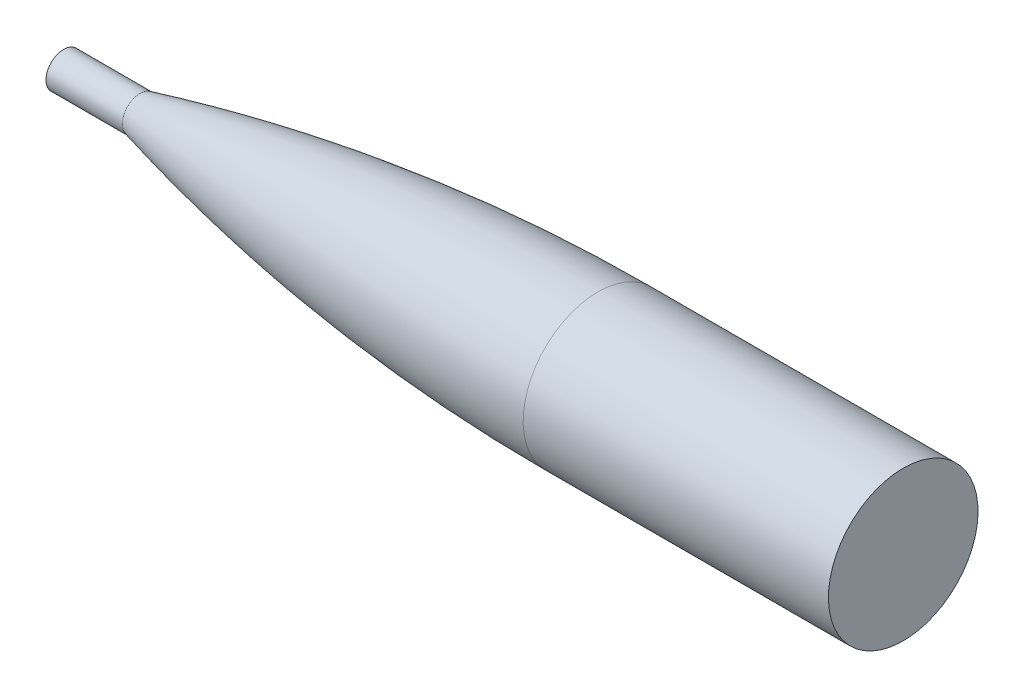
ISO-10303-21;
HEADER;
FILE_DESCRIPTION(('STEP AP214'),'2;1');
FILE_NAME('part.step','',(''),(''),'','','');
FILE_SCHEMA(('AUTOMOTIVE_DESIGN { 1 0 10303 214 1 1 1 1 }'));
ENDSEC;
DATA;
#1=APPLICATION_CONTEXT('core data for automotive mechanical design processes');
#2=APPLICATION_PROTOCOL_DEFINITION('international standard','automotive_design',2000,#1);
#3=PRODUCT_CONTEXT('',#1,'mechanical');
#4=PRODUCT('Part','Part','',(#3));
#5=PRODUCT_RELATED_PRODUCT_CATEGORY('part','',(#4));
#6=PRODUCT_DEFINITION_FORMATION('','',#4);
#7=PRODUCT_DEFINITION_CONTEXT('part definition',#1,'design');
#8=PRODUCT_DEFINITION('design','',#6,#7);
#9=PRODUCT_DEFINITION_SHAPE('','',#8);
#10=(LENGTH_UNIT() NAMED_UNIT(*) SI_UNIT(.MILLI.,.METRE.));
#11=(NAMED_UNIT(*) PLANE_ANGLE_UNIT() SI_UNIT($,.RADIAN.));
#12=(NAMED_UNIT(*) SI_UNIT($,.STERADIAN.) SOLID_ANGLE_UNIT());
#13=UNCERTAINTY_MEASURE_WITH_UNIT(LENGTH_MEASURE(1.E-05),#10,'distance_accuracy_value','');
#14=(GEOMETRIC_REPRESENTATION_CONTEXT(3) GLOBAL_UNCERTAINTY_ASSIGNED_CONTEXT((#13)) GLOBAL_UNIT_ASSIGNED_CONTEXT((#10,
#11,#12)) REPRESENTATION_CONTEXT('',''));
#15=CARTESIAN_POINT('',(0.,0.,0.));
#16=DIRECTION('',(0.,0.,1.));
#17=DIRECTION('',(1.,0.,0.));
#18=AXIS2_PLACEMENT_3D('',#15,#16,#17);
#19=CARTESIAN_POINT('',(304.799999990287,49.7839999999356,0.));
#20=CARTESIAN_POINT('',(304.362420109321,49.7839999999268,0.));
#21=CARTESIAN_POINT('',(303.482211221152,49.7834088052548,0.));
#22=CARTESIAN_POINT('',(301.617177870666,49.7807484292649,0.));
#23=CARTESIAN_POINT('',(299.535126271052,49.7736541034944,0.));
#24=CARTESIAN_POINT('',(297.470177020612,49.7630126402219,0.));
#25=CARTESIAN_POINT('',(295.35918685804,49.7488240698795,0.));
#26=CARTESIAN_POINT('',(293.263778354198,49.7310884330478,0.));
#27=CARTESIAN_POINT('',(291.166731436806,49.7098057804495,0.));
#28=CARTESIAN_POINT('',(288.521672795546,49.6784952503172,0.));
#29=CARTESIAN_POINT('',(285.329649652529,49.6334265452577,0.));
#30=CARTESIAN_POINT('',(281.590188304048,49.5699030834589,0.));
#31=CARTESIAN_POINT('',(277.303691578309,49.48226239004,0.));
#32=CARTESIAN_POINT('',(273.017475856952,49.3798045532393,0.));
#33=CARTESIAN_POINT('',(268.731666264679,49.262530797284,0.));
#34=CARTESIAN_POINT('',(264.446272338637,49.1304425234462,0.));
#35=CARTESIAN_POINT('',(260.161369668181,48.9835413100188,0.));
#36=CARTESIAN_POINT('',(253.734807706703,48.7409727135402,0.));
#37=CARTESIAN_POINT('',(245.168015053762,48.3681837485972,0.));
#38=CARTESIAN_POINT('',(207.702302927604,46.4349626079382,0.));
#39=CARTESIAN_POINT('',(160.707329089507,42.1599209125125,0.));
#40=CARTESIAN_POINT('',(110.770450736802,35.2251211949369,0.));
#41=CARTESIAN_POINT('',(62.3339038753587,25.9763701994142,0.));
#42=CARTESIAN_POINT('',(42.4128979252964,21.742539101878,0.));
#43=CARTESIAN_POINT('',(31.9521680351812,19.4056754890413,0.));
#44=CARTESIAN_POINT('',(26.7272384393463,18.2131472626268,0.));
#45=CARTESIAN_POINT('',(22.5506525227574,17.2446900479098,0.));
#46=CARTESIAN_POINT('',(18.9102609099226,16.3872914736853,0.));
#47=CARTESIAN_POINT('',(15.8050492233456,15.6465359898865,0.));
#48=CARTESIAN_POINT('',(13.2334128844101,15.0268619640981,0.));
#49=CARTESIAN_POINT('',(11.1954442275076,14.5321411193525,0.));
#50=CARTESIAN_POINT('',(9.15994822447513,14.0343879217128,0.));
#51=CARTESIAN_POINT('',(7.11012855188908,13.5293440242189,0.));
#52=CARTESIAN_POINT('',(5.10622259628834,13.032281092588,0.));
#53=CARTESIAN_POINT('',(3.08541050477275,12.5272726670259,0.));
#54=CARTESIAN_POINT('',(1.27776800563499,12.0717339202754,0.));
#55=CARTESIAN_POINT('',(0.424160674864923,11.8559326777936,0.));
#56=CARTESIAN_POINT('',(-8.94262127456441E-09,11.7483971703143,0.));
#57=B_SPLINE_CURVE_WITH_KNOTS('',4,(#19,#20,#21,#22,#23,#24,#25,#26,#27,#28,#29,#30,#31,#32,#33,
#34,#35,#36,#37,#38,#39,#40,#41,#42,#43,#44,#45,#46,#47,#48,#49,#50,#51,#52,#53,#54,#55,#56),
.UNSPECIFIED.,.F.,.F.,(5,1,1,1,1,1,1,1,1,1,1,1,1,1,1,1,1,1,1,1,1,1,1,1,1,1,1,1,1,1,1,1,1,1,5),
(0.0829178151015879,0.0886015106363571,0.0942852061412064,0.0999689016460558,0.105652597150905,
0.111336292655755,0.117019988160604,0.122703683665453,0.128387379170303,0.140005214528904,
0.151623049887505,0.163240885246106,0.174858720604706,0.18647655605003,0.198094391495354,
0.209712226940678,0.221330062386002,0.256183568844847,0.291037074687809,0.616336464163029,
0.732514817876367,0.802221831447538,0.825457500655397,0.837075336998531,0.848693173341665,
0.8603110096848,0.871928846027934,0.877612541812259,0.883296237596584,0.888979933380909,
0.894663629165234,0.900347324949559,0.906031020733883,0.911714716518208,0.917398412270913),.UNSPECIFIED.);
#58=CARTESIAN_POINT('',(304.799999999505,0.,0.));
#59=DIRECTION('',(1.,0.,0.));
#60=AXIS1_PLACEMENT('',#58,#59);
#61=SURFACE_OF_REVOLUTION('',#57,#60);
#62=CARTESIAN_POINT('',(0.,0.,0.));
#63=DIRECTION('',(-1.,0.,0.));
#64=DIRECTION('',(0.,-1.,0.));
#65=AXIS2_PLACEMENT_3D('',#62,#63,#64);
#66=CIRCLE('',#65,11.7483971703143);
#67=CARTESIAN_POINT('',(0.,-11.7483971703143,0.));
#68=VERTEX_POINT('',#67);
#69=EDGE_CURVE('E59',#68,#68,#66,.T.);
#70=ORIENTED_EDGE('',*,*,#69,.F.);
#71=EDGE_LOOP('',(#70));
#72=FACE_BOUND('',#71,.T.);
#73=CARTESIAN_POINT('',(304.799999999505,0.,0.));
#74=DIRECTION('',(1.,0.,0.));
#75=DIRECTION('',(0.,1.,0.));
#76=AXIS2_PLACEMENT_3D('',#73,#74,#75);
#77=CIRCLE('',#76,49.784);
#78=CARTESIAN_POINT('',(304.799999999505,49.784,0.));
#79=VERTEX_POINT('',#78);
#80=EDGE_CURVE('E10',#79,#79,#77,.T.);
#81=ORIENTED_EDGE('',*,*,#80,.F.);
#82=EDGE_LOOP('',(#81));
#83=FACE_BOUND('',#82,.T.);
#84=ADVANCED_FACE('F41',(#72,#83),#61,.F.);
#85=CARTESIAN_POINT('',(507.999999999505,0.,0.));
#86=DIRECTION('',(-1.,0.,0.));
#87=DIRECTION('',(0.,-1.,0.));
#88=AXIS2_PLACEMENT_3D('',#85,#86,#87);
#89=CYLINDRICAL_SURFACE('',#88,49.784);
#90=CARTESIAN_POINT('',(507.999999999505,0.,0.));
#91=DIRECTION('',(1.,0.,0.));
#92=DIRECTION('',(0.,1.,0.));
#93=AXIS2_PLACEMENT_3D('',#90,#91,#92);
#94=CIRCLE('',#93,49.784);
#95=CARTESIAN_POINT('',(507.999999999505,49.784,0.));
#96=VERTEX_POINT('',#95);
#97=EDGE_CURVE('E48',#96,#96,#94,.T.);
#98=ORIENTED_EDGE('',*,*,#97,.F.);
#99=EDGE_LOOP('',(#98));
#100=FACE_BOUND('',#99,.T.);
#101=ORIENTED_EDGE('',*,*,#80,.T.);
#102=EDGE_LOOP('',(#101));
#103=FACE_BOUND('',#102,.T.);
#104=ADVANCED_FACE('F76',(#100,#103),#89,.T.);
#105=CARTESIAN_POINT('',(507.999999999505,0.,0.));
#106=DIRECTION('',(1.,0.,0.));
#107=DIRECTION('',(0.,1.,0.));
#108=AXIS2_PLACEMENT_3D('',#105,#106,#107);
#109=PLANE('',#108);
#110=ORIENTED_EDGE('',*,*,#97,.T.);
#111=EDGE_LOOP('',(#110));
#112=FACE_BOUND('',#111,.T.);
#113=ADVANCED_FACE('F80',(#112),#109,.T.);
#114=CARTESIAN_POINT('',(-50.8,0.,0.));
#115=DIRECTION('',(1.,0.,0.));
#116=DIRECTION('',(0.,1.,0.));
#117=AXIS2_PLACEMENT_3D('',#114,#115,#116);
#118=CYLINDRICAL_SURFACE('',#117,11.7483971703143);
#119=CARTESIAN_POINT('',(-50.8,0.,0.));
#120=DIRECTION('',(-1.,0.,0.));
#121=DIRECTION('',(0.,-1.,0.));
#122=AXIS2_PLACEMENT_3D('',#119,#120,#121);
#123=CIRCLE('',#122,11.7483971703143);
#124=CARTESIAN_POINT('',(-50.8,-11.7483971703143,0.));
#125=VERTEX_POINT('',#124);
#126=EDGE_CURVE('E53',#125,#125,#123,.T.);
#127=ORIENTED_EDGE('',*,*,#126,.F.);
#128=EDGE_LOOP('',(#127));
#129=FACE_BOUND('',#128,.T.);
#130=ORIENTED_EDGE('',*,*,#69,.T.);
#131=EDGE_LOOP('',(#130));
#132=FACE_BOUND('',#131,.T.);
#133=ADVANCED_FACE('F72',(#129,#132),#118,.T.);
#134=CARTESIAN_POINT('',(-50.8,0.,0.));
#135=DIRECTION('',(-1.,0.,0.));
#136=DIRECTION('',(0.,-1.,0.));
#137=AXIS2_PLACEMENT_3D('',#134,#135,#136);
#138=PLANE('',#137);
#139=ORIENTED_EDGE('',*,*,#126,.T.);
#140=EDGE_LOOP('',(#139));
#141=FACE_BOUND('',#140,.T.);
#142=ADVANCED_FACE('F89',(#141),#138,.T.);
#143=CLOSED_SHELL('',(#84,#104,#113,#133,#142));
#144=MANIFOLD_SOLID_BREP('B2',#143);
#145=ADVANCED_BREP_SHAPE_REPRESENTATION('',(#18,#144),#14);
#146=SHAPE_DEFINITION_REPRESENTATION(#9,#145);
ENDSEC;
END-ISO-10303-21;
